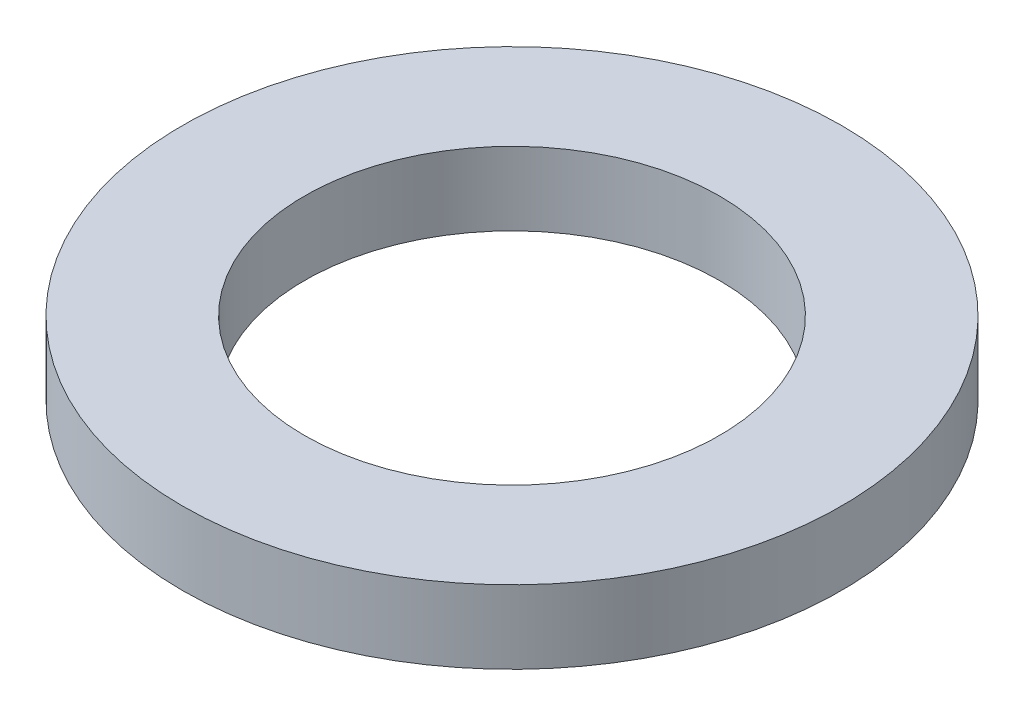
ISO-10303-21;
HEADER;
FILE_DESCRIPTION(('STEP AP214'),'2;1');
FILE_NAME('part.step','',(''),(''),'','','');
FILE_SCHEMA(('AUTOMOTIVE_DESIGN { 1 0 10303 214 1 1 1 1 }'));
ENDSEC;
DATA;
#1=APPLICATION_CONTEXT('core data for automotive mechanical design processes');
#2=APPLICATION_PROTOCOL_DEFINITION('international standard','automotive_design',2000,#1);
#3=PRODUCT_CONTEXT('',#1,'mechanical');
#4=PRODUCT('Part','Part','',(#3));
#5=PRODUCT_RELATED_PRODUCT_CATEGORY('part','',(#4));
#6=PRODUCT_DEFINITION_FORMATION('','',#4);
#7=PRODUCT_DEFINITION_CONTEXT('part definition',#1,'design');
#8=PRODUCT_DEFINITION('design','',#6,#7);
#9=PRODUCT_DEFINITION_SHAPE('','',#8);
#10=(LENGTH_UNIT() NAMED_UNIT(*) SI_UNIT(.MILLI.,.METRE.));
#11=(NAMED_UNIT(*) PLANE_ANGLE_UNIT() SI_UNIT($,.RADIAN.));
#12=(NAMED_UNIT(*) SI_UNIT($,.STERADIAN.) SOLID_ANGLE_UNIT());
#13=UNCERTAINTY_MEASURE_WITH_UNIT(LENGTH_MEASURE(1.E-05),#10,'distance_accuracy_value','');
#14=(GEOMETRIC_REPRESENTATION_CONTEXT(3) GLOBAL_UNCERTAINTY_ASSIGNED_CONTEXT((#13)) GLOBAL_UNIT_ASSIGNED_CONTEXT((#10,
#11,#12)) REPRESENTATION_CONTEXT('',''));
#15=CARTESIAN_POINT('',(0.,0.,0.));
#16=DIRECTION('',(0.,0.,1.));
#17=DIRECTION('',(1.,0.,0.));
#18=AXIS2_PLACEMENT_3D('',#15,#16,#17);
#19=CARTESIAN_POINT('',(0.,15.,0.));
#20=DIRECTION('',(0.,-1.,0.));
#21=DIRECTION('',(0.,0.,-1.));
#22=AXIS2_PLACEMENT_3D('',#19,#20,#21);
#23=CYLINDRICAL_SURFACE('',#22,67.5);
#24=CARTESIAN_POINT('',(0.,15.,0.));
#25=DIRECTION('',(0.,1.,0.));
#26=DIRECTION('',(0.,0.,1.));
#27=AXIS2_PLACEMENT_3D('',#24,#25,#26);
#28=CIRCLE('',#27,67.5);
#29=CARTESIAN_POINT('',(0.,15.,67.5));
#30=VERTEX_POINT('',#29);
#31=EDGE_CURVE('E10',#30,#30,#28,.T.);
#32=ORIENTED_EDGE('',*,*,#31,.F.);
#33=EDGE_LOOP('',(#32));
#34=FACE_BOUND('',#33,.T.);
#35=CARTESIAN_POINT('',(0.,0.,0.));
#36=DIRECTION('',(0.,1.,0.));
#37=DIRECTION('',(0.,0.,1.));
#38=AXIS2_PLACEMENT_3D('',#35,#36,#37);
#39=CIRCLE('',#38,67.5);
#40=CARTESIAN_POINT('',(0.,0.,67.5));
#41=VERTEX_POINT('',#40);
#42=EDGE_CURVE('E37',#41,#41,#39,.T.);
#43=ORIENTED_EDGE('',*,*,#42,.T.);
#44=EDGE_LOOP('',(#43));
#45=FACE_BOUND('',#44,.T.);
#46=ADVANCED_FACE('F40',(#34,#45),#23,.T.);
#47=CARTESIAN_POINT('',(0.,15.,0.));
#48=DIRECTION('',(0.,1.,0.));
#49=DIRECTION('',(0.,0.,1.));
#50=AXIS2_PLACEMENT_3D('',#47,#48,#49);
#51=PLANE('',#50);
#52=CARTESIAN_POINT('',(0.,15.,0.));
#53=DIRECTION('',(0.,1.,0.));
#54=DIRECTION('',(0.,0.,1.));
#55=AXIS2_PLACEMENT_3D('',#52,#53,#54);
#56=CIRCLE('',#55,42.5);
#57=CARTESIAN_POINT('',(0.,15.,42.5));
#58=VERTEX_POINT('',#57);
#59=EDGE_CURVE('E50',#58,#58,#56,.T.);
#60=ORIENTED_EDGE('',*,*,#59,.F.);
#61=EDGE_LOOP('',(#60));
#62=FACE_BOUND('',#61,.T.);
#63=ORIENTED_EDGE('',*,*,#31,.T.);
#64=EDGE_LOOP('',(#63));
#65=FACE_BOUND('',#64,.T.);
#66=ADVANCED_FACE('F59',(#62,#65),#51,.T.);
#67=CARTESIAN_POINT('',(0.,0.,0.));
#68=DIRECTION('',(0.,1.,0.));
#69=DIRECTION('',(0.,0.,1.));
#70=AXIS2_PLACEMENT_3D('',#67,#68,#69);
#71=PLANE('',#70);
#72=CARTESIAN_POINT('',(0.,0.,0.));
#73=DIRECTION('',(0.,1.,0.));
#74=DIRECTION('',(0.,0.,1.));
#75=AXIS2_PLACEMENT_3D('',#72,#73,#74);
#76=CIRCLE('',#75,42.5);
#77=CARTESIAN_POINT('',(0.,0.,42.5));
#78=VERTEX_POINT('',#77);
#79=EDGE_CURVE('E47',#78,#78,#76,.T.);
#80=ORIENTED_EDGE('',*,*,#79,.T.);
#81=EDGE_LOOP('',(#80));
#82=FACE_BOUND('',#81,.T.);
#83=ORIENTED_EDGE('',*,*,#42,.F.);
#84=EDGE_LOOP('',(#83));
#85=FACE_BOUND('',#84,.T.);
#86=ADVANCED_FACE('F58',(#82,#85),#71,.F.);
#87=CARTESIAN_POINT('',(0.,15.,0.));
#88=DIRECTION('',(0.,-1.,0.));
#89=DIRECTION('',(0.,0.,-1.));
#90=AXIS2_PLACEMENT_3D('',#87,#88,#89);
#91=CYLINDRICAL_SURFACE('',#90,42.5);
#92=ORIENTED_EDGE('',*,*,#59,.T.);
#93=EDGE_LOOP('',(#92));
#94=FACE_BOUND('',#93,.T.);
#95=ORIENTED_EDGE('',*,*,#79,.F.);
#96=EDGE_LOOP('',(#95));
#97=FACE_BOUND('',#96,.T.);
#98=ADVANCED_FACE('F54',(#94,#97),#91,.F.);
#99=CLOSED_SHELL('',(#46,#66,#86,#98));
#100=MANIFOLD_SOLID_BREP('B2',#99);
#101=ADVANCED_BREP_SHAPE_REPRESENTATION('',(#18,#100),#14);
#102=SHAPE_DEFINITION_REPRESENTATION(#9,#101);
ENDSEC;
END-ISO-10303-21;
